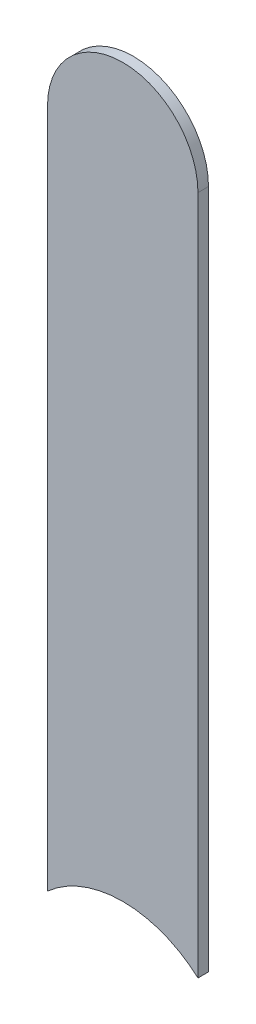
ISO-10303-21;
HEADER;
FILE_DESCRIPTION(('STEP AP214'),'2;1');
FILE_NAME('part.step','',(''),(''),'','','');
FILE_SCHEMA(('AUTOMOTIVE_DESIGN { 1 0 10303 214 1 1 1 1 }'));
ENDSEC;
DATA;
#1=APPLICATION_CONTEXT('core data for automotive mechanical design processes');
#2=APPLICATION_PROTOCOL_DEFINITION('international standard','automotive_design',2000,#1);
#3=PRODUCT_CONTEXT('',#1,'mechanical');
#4=PRODUCT('Part','Part','',(#3));
#5=PRODUCT_RELATED_PRODUCT_CATEGORY('part','',(#4));
#6=PRODUCT_DEFINITION_FORMATION('','',#4);
#7=PRODUCT_DEFINITION_CONTEXT('part definition',#1,'design');
#8=PRODUCT_DEFINITION('design','',#6,#7);
#9=PRODUCT_DEFINITION_SHAPE('','',#8);
#10=(LENGTH_UNIT() NAMED_UNIT(*) SI_UNIT(.MILLI.,.METRE.));
#11=(NAMED_UNIT(*) PLANE_ANGLE_UNIT() SI_UNIT($,.RADIAN.));
#12=(NAMED_UNIT(*) SI_UNIT($,.STERADIAN.) SOLID_ANGLE_UNIT());
#13=UNCERTAINTY_MEASURE_WITH_UNIT(LENGTH_MEASURE(1.E-05),#10,'distance_accuracy_value','');
#14=(GEOMETRIC_REPRESENTATION_CONTEXT(3) GLOBAL_UNCERTAINTY_ASSIGNED_CONTEXT((#13)) GLOBAL_UNIT_ASSIGNED_CONTEXT((#10,
#11,#12)) REPRESENTATION_CONTEXT('',''));
#15=CARTESIAN_POINT('',(0.,0.,0.));
#16=DIRECTION('',(0.,0.,1.));
#17=DIRECTION('',(1.,0.,0.));
#18=AXIS2_PLACEMENT_3D('',#15,#16,#17);
#19=CARTESIAN_POINT('',(124.71,-80.772,-0.035));
#20=DIRECTION('',(-1.,0.,0.));
#21=DIRECTION('',(0.,0.,1.));
#22=AXIS2_PLACEMENT_3D('',#19,#20,#21);
#23=PLANE('',#22);
#24=DIRECTION('',(0.,0.,1.));
#25=VECTOR('',#24,1.);
#26=CARTESIAN_POINT('',(124.71,-78.232,-0.035));
#27=LINE('',#26,#25);
#28=CARTESIAN_POINT('',(124.71,-78.232,-0.035));
#29=VERTEX_POINT('',#28);
#30=CARTESIAN_POINT('',(124.71,-78.232,0.));
#31=VERTEX_POINT('',#30);
#32=EDGE_CURVE('E11',#29,#31,#27,.T.);
#33=ORIENTED_EDGE('',*,*,#32,.T.);
#34=DIRECTION('',(0.,1.,0.));
#35=VECTOR('',#34,1.);
#36=CARTESIAN_POINT('',(124.71,-80.772,0.));
#37=LINE('',#36,#35);
#38=CARTESIAN_POINT('',(124.71,-80.49249150282,0.));
#39=VERTEX_POINT('',#38);
#40=EDGE_CURVE('E20',#39,#31,#37,.T.);
#41=ORIENTED_EDGE('',*,*,#40,.F.);
#42=DIRECTION('',(0.,0.,-1.));
#43=VECTOR('',#42,1.);
#44=CARTESIAN_POINT('',(124.71,-80.49249150281,-0.045));
#45=LINE('',#44,#43);
#46=CARTESIAN_POINT('',(124.71,-80.49249150282,-0.035));
#47=VERTEX_POINT('',#46);
#48=EDGE_CURVE('E74',#39,#47,#45,.T.);
#49=ORIENTED_EDGE('',*,*,#48,.T.);
#50=DIRECTION('',(0.,1.,0.));
#51=VECTOR('',#50,1.);
#52=CARTESIAN_POINT('',(124.71,-80.772,-0.035));
#53=LINE('',#52,#51);
#54=EDGE_CURVE('E105',#47,#29,#53,.T.);
#55=ORIENTED_EDGE('',*,*,#54,.T.);
#56=EDGE_LOOP('',(#33,#41,#49,#55));
#57=FACE_BOUND('',#56,.T.);
#58=ADVANCED_FACE('F17',(#57),#23,.F.);
#59=CARTESIAN_POINT('',(124.46,-78.232,-0.035));
#60=DIRECTION('',(0.,0.,-1.));
#61=DIRECTION('',(1.,0.,0.));
#62=AXIS2_PLACEMENT_3D('',#59,#60,#61);
#63=CYLINDRICAL_SURFACE('',#62,0.25);
#64=CARTESIAN_POINT('',(124.46,-78.232,-0.035));
#65=DIRECTION('',(0.,0.,1.));
#66=DIRECTION('',(1.,0.,0.));
#67=AXIS2_PLACEMENT_3D('',#64,#65,#66);
#68=CIRCLE('',#67,0.25);
#69=CARTESIAN_POINT('',(124.21,-78.232,-0.035));
#70=VERTEX_POINT('',#69);
#71=EDGE_CURVE('E77',#29,#70,#68,.T.);
#72=ORIENTED_EDGE('',*,*,#71,.T.);
#73=DIRECTION('',(0.,0.,1.));
#74=VECTOR('',#73,1.);
#75=CARTESIAN_POINT('',(124.21,-78.232,-0.035));
#76=LINE('',#75,#74);
#77=CARTESIAN_POINT('',(124.21,-78.232,0.));
#78=VERTEX_POINT('',#77);
#79=EDGE_CURVE('E88',#70,#78,#76,.T.);
#80=ORIENTED_EDGE('',*,*,#79,.T.);
#81=CARTESIAN_POINT('',(124.46,-78.232,0.));
#82=DIRECTION('',(0.,0.,1.));
#83=DIRECTION('',(1.,0.,0.));
#84=AXIS2_PLACEMENT_3D('',#81,#82,#83);
#85=CIRCLE('',#84,0.25);
#86=EDGE_CURVE('E83',#31,#78,#85,.T.);
#87=ORIENTED_EDGE('',*,*,#86,.F.);
#88=ORIENTED_EDGE('',*,*,#32,.F.);
#89=EDGE_LOOP('',(#72,#80,#87,#88));
#90=FACE_BOUND('',#89,.T.);
#91=ADVANCED_FACE('F182',(#90),#63,.T.);
#92=CARTESIAN_POINT('',(124.21,-78.232,0.));
#93=DIRECTION('',(0.,0.,1.));
#94=DIRECTION('',(1.,0.,0.));
#95=AXIS2_PLACEMENT_3D('',#92,#93,#94);
#96=PLANE('',#95);
#97=ORIENTED_EDGE('',*,*,#86,.T.);
#98=DIRECTION('',(0.,-1.,0.));
#99=VECTOR('',#98,1.);
#100=CARTESIAN_POINT('',(124.21,-78.232,0.));
#101=LINE('',#100,#99);
#102=CARTESIAN_POINT('',(124.21,-80.49249150281,0.));
#103=VERTEX_POINT('',#102);
#104=EDGE_CURVE('E80',#78,#103,#101,.T.);
#105=ORIENTED_EDGE('',*,*,#104,.T.);
#106=CARTESIAN_POINT('',(124.46,-80.772,0.));
#107=DIRECTION('',(0.,0.,-1.));
#108=DIRECTION('',(0.,-1.,0.));
#109=AXIS2_PLACEMENT_3D('',#106,#107,#108);
#110=CIRCLE('',#109,0.375);
#111=EDGE_CURVE('E68',#103,#39,#110,.T.);
#112=ORIENTED_EDGE('',*,*,#111,.T.);
#113=ORIENTED_EDGE('',*,*,#40,.T.);
#114=EDGE_LOOP('',(#97,#105,#112,#113));
#115=FACE_BOUND('',#114,.T.);
#116=ADVANCED_FACE('F81',(#115),#96,.T.);
#117=CARTESIAN_POINT('',(124.46,-80.772,-0.045));
#118=DIRECTION('',(0.,0.,-1.));
#119=DIRECTION('',(0.,-1.,0.));
#120=AXIS2_PLACEMENT_3D('',#117,#118,#119);
#121=CYLINDRICAL_SURFACE('',#120,0.375);
#122=ORIENTED_EDGE('',*,*,#111,.F.);
#123=DIRECTION('',(0.,0.,-1.));
#124=VECTOR('',#123,1.);
#125=CARTESIAN_POINT('',(124.21,-80.49249150281,-0.045));
#126=LINE('',#125,#124);
#127=CARTESIAN_POINT('',(124.21,-80.49249150281,-0.035));
#128=VERTEX_POINT('',#127);
#129=EDGE_CURVE('E73',#103,#128,#126,.T.);
#130=ORIENTED_EDGE('',*,*,#129,.T.);
#131=CARTESIAN_POINT('',(124.46,-80.772,-0.035));
#132=DIRECTION('',(0.,0.,-1.));
#133=DIRECTION('',(0.,-1.,0.));
#134=AXIS2_PLACEMENT_3D('',#131,#132,#133);
#135=CIRCLE('',#134,0.375);
#136=EDGE_CURVE('E107',#128,#47,#135,.T.);
#137=ORIENTED_EDGE('',*,*,#136,.T.);
#138=ORIENTED_EDGE('',*,*,#48,.F.);
#139=EDGE_LOOP('',(#122,#130,#137,#138));
#140=FACE_BOUND('',#139,.T.);
#141=ADVANCED_FACE('F70',(#140),#121,.F.);
#142=CARTESIAN_POINT('',(124.21,-78.232,-0.035));
#143=DIRECTION('',(0.,0.,1.));
#144=DIRECTION('',(1.,0.,0.));
#145=AXIS2_PLACEMENT_3D('',#142,#143,#144);
#146=PLANE('',#145);
#147=ORIENTED_EDGE('',*,*,#54,.F.);
#148=ORIENTED_EDGE('',*,*,#136,.F.);
#149=DIRECTION('',(0.,-1.,0.));
#150=VECTOR('',#149,1.);
#151=CARTESIAN_POINT('',(124.21,-78.232,-0.035));
#152=LINE('',#151,#150);
#153=EDGE_CURVE('E93',#70,#128,#152,.T.);
#154=ORIENTED_EDGE('',*,*,#153,.F.);
#155=ORIENTED_EDGE('',*,*,#71,.F.);
#156=EDGE_LOOP('',(#147,#148,#154,#155));
#157=FACE_BOUND('',#156,.T.);
#158=ADVANCED_FACE('F118',(#157),#146,.F.);
#159=CARTESIAN_POINT('',(124.21,-78.232,-0.035));
#160=DIRECTION('',(1.,0.,0.));
#161=DIRECTION('',(0.,1.,0.));
#162=AXIS2_PLACEMENT_3D('',#159,#160,#161);
#163=PLANE('',#162);
#164=ORIENTED_EDGE('',*,*,#129,.F.);
#165=ORIENTED_EDGE('',*,*,#104,.F.);
#166=ORIENTED_EDGE('',*,*,#79,.F.);
#167=ORIENTED_EDGE('',*,*,#153,.T.);
#168=EDGE_LOOP('',(#164,#165,#166,#167));
#169=FACE_BOUND('',#168,.T.);
#170=ADVANCED_FACE('F91',(#169),#163,.F.);
#171=CLOSED_SHELL('',(#58,#91,#116,#141,#158,#170));
#172=MANIFOLD_SOLID_BREP('B1',#171);
#173=ADVANCED_BREP_SHAPE_REPRESENTATION('',(#18,#172),#14);
#174=SHAPE_DEFINITION_REPRESENTATION(#9,#173);
ENDSEC;
END-ISO-10303-21;
